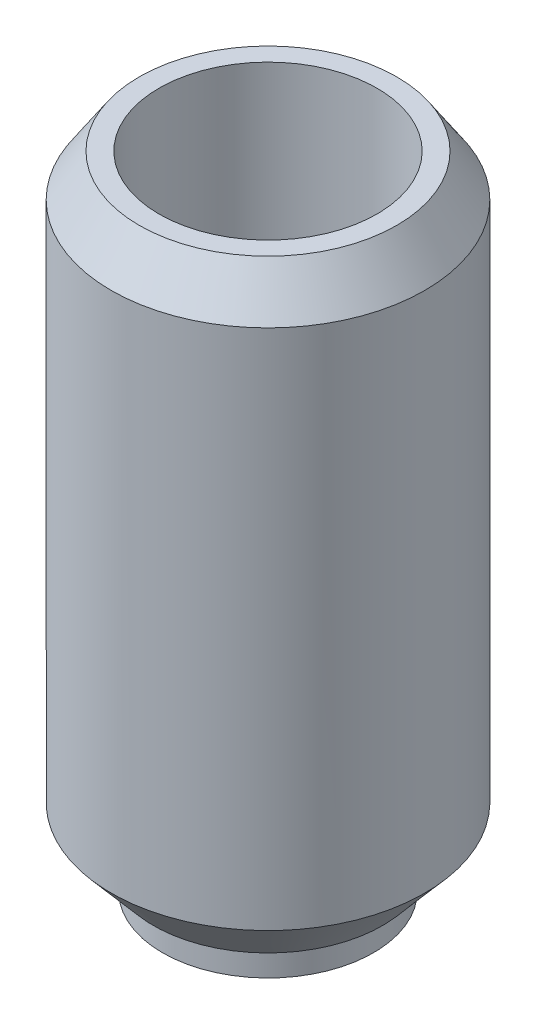
ISO-10303-21;
HEADER;
FILE_DESCRIPTION(('STEP AP214'),'2;1');
FILE_NAME('part.step','',(''),(''),'','','');
FILE_SCHEMA(('AUTOMOTIVE_DESIGN { 1 0 10303 214 1 1 1 1 }'));
ENDSEC;
DATA;
#1=APPLICATION_CONTEXT('core data for automotive mechanical design processes');
#2=APPLICATION_PROTOCOL_DEFINITION('international standard','automotive_design',2000,#1);
#3=PRODUCT_CONTEXT('',#1,'mechanical');
#4=PRODUCT('Part','Part','',(#3));
#5=PRODUCT_RELATED_PRODUCT_CATEGORY('part','',(#4));
#6=PRODUCT_DEFINITION_FORMATION('','',#4);
#7=PRODUCT_DEFINITION_CONTEXT('part definition',#1,'design');
#8=PRODUCT_DEFINITION('design','',#6,#7);
#9=PRODUCT_DEFINITION_SHAPE('','',#8);
#10=(LENGTH_UNIT() NAMED_UNIT(*) SI_UNIT(.MILLI.,.METRE.));
#11=(NAMED_UNIT(*) PLANE_ANGLE_UNIT() SI_UNIT($,.RADIAN.));
#12=(NAMED_UNIT(*) SI_UNIT($,.STERADIAN.) SOLID_ANGLE_UNIT());
#13=UNCERTAINTY_MEASURE_WITH_UNIT(LENGTH_MEASURE(1.E-05),#10,'distance_accuracy_value','');
#14=(GEOMETRIC_REPRESENTATION_CONTEXT(3) GLOBAL_UNCERTAINTY_ASSIGNED_CONTEXT((#13)) GLOBAL_UNIT_ASSIGNED_CONTEXT((#10,
#11,#12)) REPRESENTATION_CONTEXT('',''));
#15=CARTESIAN_POINT('',(0.,0.,0.));
#16=DIRECTION('',(0.,0.,1.));
#17=DIRECTION('',(1.,0.,0.));
#18=AXIS2_PLACEMENT_3D('',#15,#16,#17);
#19=CARTESIAN_POINT('',(0.,45.6,0.));
#20=DIRECTION('',(0.,-1.,0.));
#21=DIRECTION('',(0.,0.,-1.));
#22=AXIS2_PLACEMENT_3D('',#19,#20,#21);
#23=CYLINDRICAL_SURFACE('',#22,11.15);
#24=CARTESIAN_POINT('',(0.,5.50000000000003,0.));
#25=DIRECTION('',(0.,-1.,0.));
#26=DIRECTION('',(0.,0.,-1.));
#27=AXIS2_PLACEMENT_3D('',#24,#25,#26);
#28=CIRCLE('',#27,11.15);
#29=CARTESIAN_POINT('',(0.,5.50000000000003,-11.15));
#30=VERTEX_POINT('',#29);
#31=EDGE_CURVE('E10',#30,#30,#28,.F.);
#32=ORIENTED_EDGE('',*,*,#31,.T.);
#33=EDGE_LOOP('',(#32));
#34=FACE_BOUND('',#33,.T.);
#35=CARTESIAN_POINT('',(0.,42.6,0.));
#36=DIRECTION('',(0.,1.,0.));
#37=DIRECTION('',(0.,0.,1.));
#38=AXIS2_PLACEMENT_3D('',#35,#36,#37);
#39=CIRCLE('',#38,11.15);
#40=CARTESIAN_POINT('',(0.,42.6,11.15));
#41=VERTEX_POINT('',#40);
#42=EDGE_CURVE('E50',#41,#41,#39,.F.);
#43=ORIENTED_EDGE('',*,*,#42,.T.);
#44=EDGE_LOOP('',(#43));
#45=FACE_BOUND('',#44,.T.);
#46=ADVANCED_FACE('F38',(#34,#45),#23,.T.);
#47=CARTESIAN_POINT('',(0.,45.6,0.));
#48=DIRECTION('',(0.,1.,0.));
#49=DIRECTION('',(0.,0.,1.));
#50=AXIS2_PLACEMENT_3D('',#47,#48,#49);
#51=PLANE('',#50);
#52=CARTESIAN_POINT('',(0.,45.6,0.));
#53=DIRECTION('',(0.,1.,0.));
#54=DIRECTION('',(0.,0.,1.));
#55=AXIS2_PLACEMENT_3D('',#52,#53,#54);
#56=CIRCLE('',#55,9.15000000000001);
#57=CARTESIAN_POINT('',(0.,45.6,9.15000000000001));
#58=VERTEX_POINT('',#57);
#59=EDGE_CURVE('E54',#58,#58,#56,.T.);
#60=ORIENTED_EDGE('',*,*,#59,.T.);
#61=EDGE_LOOP('',(#60));
#62=FACE_BOUND('',#61,.T.);
#63=CARTESIAN_POINT('',(0.,45.6,0.));
#64=DIRECTION('',(0.,1.,0.));
#65=DIRECTION('',(0.,0.,1.));
#66=AXIS2_PLACEMENT_3D('',#63,#64,#65);
#67=CIRCLE('',#66,7.75);
#68=CARTESIAN_POINT('',(0.,45.6,7.75));
#69=VERTEX_POINT('',#68);
#70=EDGE_CURVE('E60',#69,#69,#67,.T.);
#71=ORIENTED_EDGE('',*,*,#70,.F.);
#72=EDGE_LOOP('',(#71));
#73=FACE_BOUND('',#72,.T.);
#74=ADVANCED_FACE('F98',(#62,#73),#51,.T.);
#75=CARTESIAN_POINT('',(0.,12.6,0.));
#76=DIRECTION('',(0.,1.,0.));
#77=DIRECTION('',(0.,0.,1.));
#78=AXIS2_PLACEMENT_3D('',#75,#76,#77);
#79=CYLINDRICAL_SURFACE('',#78,7.75);
#80=CARTESIAN_POINT('',(0.,12.6,0.));
#81=DIRECTION('',(0.,1.,0.));
#82=DIRECTION('',(0.,0.,1.));
#83=AXIS2_PLACEMENT_3D('',#80,#81,#82);
#84=CIRCLE('',#83,7.75);
#85=CARTESIAN_POINT('',(0.,12.6,7.75));
#86=VERTEX_POINT('',#85);
#87=EDGE_CURVE('E59',#86,#86,#84,.T.);
#88=ORIENTED_EDGE('',*,*,#87,.F.);
#89=EDGE_LOOP('',(#88));
#90=FACE_BOUND('',#89,.T.);
#91=ORIENTED_EDGE('',*,*,#70,.T.);
#92=EDGE_LOOP('',(#91));
#93=FACE_BOUND('',#92,.T.);
#94=ADVANCED_FACE('F103',(#90,#93),#79,.F.);
#95=CARTESIAN_POINT('',(0.,12.6,0.));
#96=DIRECTION('',(0.,1.,0.));
#97=DIRECTION('',(0.,0.,1.));
#98=AXIS2_PLACEMENT_3D('',#95,#96,#97);
#99=PLANE('',#98);
#100=CARTESIAN_POINT('',(0.,12.6,0.));
#101=DIRECTION('',(0.,1.,0.));
#102=DIRECTION('',(0.,0.,1.));
#103=AXIS2_PLACEMENT_3D('',#100,#101,#102);
#104=CIRCLE('',#103,3.75);
#105=CARTESIAN_POINT('',(0.,12.6,3.75));
#106=VERTEX_POINT('',#105);
#107=EDGE_CURVE('E69',#106,#106,#104,.T.);
#108=ORIENTED_EDGE('',*,*,#107,.F.);
#109=EDGE_LOOP('',(#108));
#110=FACE_BOUND('',#109,.T.);
#111=ORIENTED_EDGE('',*,*,#87,.T.);
#112=EDGE_LOOP('',(#111));
#113=FACE_BOUND('',#112,.T.);
#114=ADVANCED_FACE('F94',(#110,#113),#99,.T.);
#115=CARTESIAN_POINT('',(0.,2.,0.));
#116=DIRECTION('',(0.,-1.,0.));
#117=DIRECTION('',(0.,0.,-1.));
#118=AXIS2_PLACEMENT_3D('',#115,#116,#117);
#119=PLANE('',#118);
#120=CARTESIAN_POINT('',(0.,2.,0.));
#121=DIRECTION('',(0.,-1.,0.));
#122=DIRECTION('',(0.,0.,-1.));
#123=AXIS2_PLACEMENT_3D('',#120,#121,#122);
#124=CIRCLE('',#123,8.14999999999999);
#125=CARTESIAN_POINT('',(0.,2.,-8.14999999999999));
#126=VERTEX_POINT('',#125);
#127=EDGE_CURVE('E46',#126,#126,#124,.T.);
#128=ORIENTED_EDGE('',*,*,#127,.T.);
#129=EDGE_LOOP('',(#128));
#130=FACE_BOUND('',#129,.T.);
#131=CARTESIAN_POINT('',(0.,2.,0.));
#132=DIRECTION('',(0.,-1.,0.));
#133=DIRECTION('',(0.,0.,-1.));
#134=AXIS2_PLACEMENT_3D('',#131,#132,#133);
#135=CIRCLE('',#134,7.5);
#136=CARTESIAN_POINT('',(0.,2.,-7.5));
#137=VERTEX_POINT('',#136);
#138=EDGE_CURVE('E63',#137,#137,#135,.T.);
#139=ORIENTED_EDGE('',*,*,#138,.F.);
#140=EDGE_LOOP('',(#139));
#141=FACE_BOUND('',#140,.T.);
#142=ADVANCED_FACE('F88',(#130,#141),#119,.T.);
#143=CARTESIAN_POINT('',(0.,2.,0.));
#144=DIRECTION('',(0.,-1.,0.));
#145=DIRECTION('',(0.,0.,-1.));
#146=AXIS2_PLACEMENT_3D('',#143,#144,#145);
#147=CYLINDRICAL_SURFACE('',#146,7.5);
#148=ORIENTED_EDGE('',*,*,#138,.T.);
#149=EDGE_LOOP('',(#148));
#150=FACE_BOUND('',#149,.T.);
#151=CARTESIAN_POINT('',(0.,0.,0.));
#152=DIRECTION('',(0.,-1.,0.));
#153=DIRECTION('',(0.,0.,-1.));
#154=AXIS2_PLACEMENT_3D('',#151,#152,#153);
#155=CIRCLE('',#154,7.5);
#156=CARTESIAN_POINT('',(0.,0.,-7.5));
#157=VERTEX_POINT('',#156);
#158=EDGE_CURVE('E66',#157,#157,#155,.T.);
#159=ORIENTED_EDGE('',*,*,#158,.F.);
#160=EDGE_LOOP('',(#159));
#161=FACE_BOUND('',#160,.T.);
#162=ADVANCED_FACE('F83',(#150,#161),#147,.T.);
#163=CARTESIAN_POINT('',(0.,0.,0.));
#164=DIRECTION('',(0.,1.,0.));
#165=DIRECTION('',(0.,0.,1.));
#166=AXIS2_PLACEMENT_3D('',#163,#164,#165);
#167=PLANE('',#166);
#168=CARTESIAN_POINT('',(0.,0.,0.));
#169=DIRECTION('',(0.,-1.,0.));
#170=DIRECTION('',(0.,0.,-1.));
#171=AXIS2_PLACEMENT_3D('',#168,#169,#170);
#172=CIRCLE('',#171,3.75);
#173=CARTESIAN_POINT('',(0.,0.,-3.75));
#174=VERTEX_POINT('',#173);
#175=EDGE_CURVE('E74',#174,#174,#172,.T.);
#176=ORIENTED_EDGE('',*,*,#175,.F.);
#177=EDGE_LOOP('',(#176));
#178=FACE_BOUND('',#177,.T.);
#179=ORIENTED_EDGE('',*,*,#158,.T.);
#180=EDGE_LOOP('',(#179));
#181=FACE_BOUND('',#180,.T.);
#182=ADVANCED_FACE('F80',(#178,#181),#167,.F.);
#183=CARTESIAN_POINT('',(0.,45.6,0.));
#184=DIRECTION('',(0.,-1.,0.));
#185=DIRECTION('',(0.,0.,-1.));
#186=AXIS2_PLACEMENT_3D('',#183,#184,#185);
#187=CYLINDRICAL_SURFACE('',#186,3.75);
#188=ORIENTED_EDGE('',*,*,#107,.T.);
#189=EDGE_LOOP('',(#188));
#190=FACE_BOUND('',#189,.T.);
#191=ORIENTED_EDGE('',*,*,#175,.T.);
#192=EDGE_LOOP('',(#191));
#193=FACE_BOUND('',#192,.T.);
#194=ADVANCED_FACE('F78',(#190,#193),#187,.F.);
#195=CARTESIAN_POINT('',(0.,45.6,0.));
#196=DIRECTION('',(0.,-1.,0.));
#197=DIRECTION('',(0.,0.,-1.));
#198=AXIS2_PLACEMENT_3D('',#195,#196,#197);
#199=CONICAL_SURFACE('',#198,9.15000000000001,0.588002603547568);
#200=ORIENTED_EDGE('',*,*,#42,.F.);
#201=EDGE_LOOP('',(#200));
#202=FACE_BOUND('',#201,.T.);
#203=ORIENTED_EDGE('',*,*,#59,.F.);
#204=EDGE_LOOP('',(#203));
#205=FACE_BOUND('',#204,.T.);
#206=ADVANCED_FACE('F108',(#202,#205),#199,.T.);
#207=CARTESIAN_POINT('',(0.,2.,0.));
#208=DIRECTION('',(0.,1.,0.));
#209=DIRECTION('',(0.,0.,1.));
#210=AXIS2_PLACEMENT_3D('',#207,#208,#209);
#211=CONICAL_SURFACE('',#210,8.14999999999999,0.708626272127668);
#212=ORIENTED_EDGE('',*,*,#31,.F.);
#213=EDGE_LOOP('',(#212));
#214=FACE_BOUND('',#213,.T.);
#215=ORIENTED_EDGE('',*,*,#127,.F.);
#216=EDGE_LOOP('',(#215));
#217=FACE_BOUND('',#216,.T.);
#218=ADVANCED_FACE('F41',(#214,#217),#211,.T.);
#219=CLOSED_SHELL('',(#46,#74,#94,#114,#142,#162,#182,#194,#206,#218));
#220=MANIFOLD_SOLID_BREP('B2',#219);
#221=ADVANCED_BREP_SHAPE_REPRESENTATION('',(#18,#220),#14);
#222=SHAPE_DEFINITION_REPRESENTATION(#9,#221);
ENDSEC;
END-ISO-10303-21;
